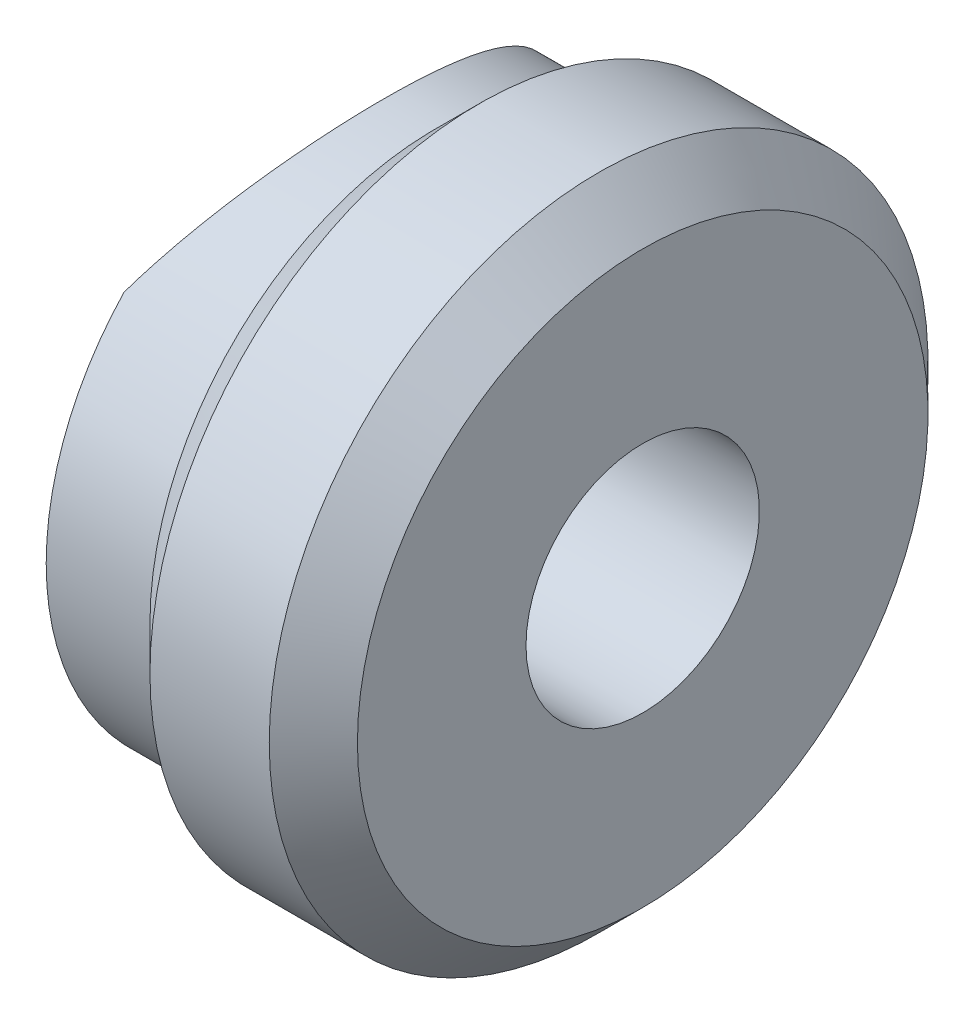
ISO-10303-21;
HEADER;
FILE_DESCRIPTION(('STEP AP214'),'2;1');
FILE_NAME('part.step','',(''),(''),'','','');
FILE_SCHEMA(('AUTOMOTIVE_DESIGN { 1 0 10303 214 1 1 1 1 }'));
ENDSEC;
DATA;
#1=APPLICATION_CONTEXT('core data for automotive mechanical design processes');
#2=APPLICATION_PROTOCOL_DEFINITION('international standard','automotive_design',2000,#1);
#3=PRODUCT_CONTEXT('',#1,'mechanical');
#4=PRODUCT('Part','Part','',(#3));
#5=PRODUCT_RELATED_PRODUCT_CATEGORY('part','',(#4));
#6=PRODUCT_DEFINITION_FORMATION('','',#4);
#7=PRODUCT_DEFINITION_CONTEXT('part definition',#1,'design');
#8=PRODUCT_DEFINITION('design','',#6,#7);
#9=PRODUCT_DEFINITION_SHAPE('','',#8);
#10=(LENGTH_UNIT() NAMED_UNIT(*) SI_UNIT(.MILLI.,.METRE.));
#11=(NAMED_UNIT(*) PLANE_ANGLE_UNIT() SI_UNIT($,.RADIAN.));
#12=(NAMED_UNIT(*) SI_UNIT($,.STERADIAN.) SOLID_ANGLE_UNIT());
#13=UNCERTAINTY_MEASURE_WITH_UNIT(LENGTH_MEASURE(1.E-05),#10,'distance_accuracy_value','');
#14=(GEOMETRIC_REPRESENTATION_CONTEXT(3) GLOBAL_UNCERTAINTY_ASSIGNED_CONTEXT((#13)) GLOBAL_UNIT_ASSIGNED_CONTEXT((#10,
#11,#12)) REPRESENTATION_CONTEXT('',''));
#15=CARTESIAN_POINT('',(0.,0.,0.));
#16=DIRECTION('',(0.,0.,1.));
#17=DIRECTION('',(1.,0.,0.));
#18=AXIS2_PLACEMENT_3D('',#15,#16,#17);
#19=CARTESIAN_POINT('',(0.,5.5,0.));
#20=DIRECTION('',(1.,0.,0.));
#21=DIRECTION('',(0.,0.,-1.));
#22=AXIS2_PLACEMENT_3D('',#19,#20,#21);
#23=PLANE('',#22);
#24=CARTESIAN_POINT('',(0.,0.,0.));
#25=DIRECTION('',(-1.,0.,0.));
#26=DIRECTION('',(0.,0.,1.));
#27=AXIS2_PLACEMENT_3D('',#24,#25,#26);
#28=CIRCLE('',#27,5.5);
#29=CARTESIAN_POINT('',(0.,3.77491721763537,-4.));
#30=VERTEX_POINT('',#29);
#31=CARTESIAN_POINT('',(0.,-3.77491721763537,-4.));
#32=VERTEX_POINT('',#31);
#33=EDGE_CURVE('E75',#30,#32,#28,.T.);
#34=ORIENTED_EDGE('',*,*,#33,.T.);
#35=DIRECTION('',(0.,1.,0.));
#36=VECTOR('',#35,1.);
#37=CARTESIAN_POINT('',(0.,-6.35,-4.));
#38=LINE('',#37,#36);
#39=EDGE_CURVE('E62',#32,#30,#38,.T.);
#40=ORIENTED_EDGE('',*,*,#39,.T.);
#41=EDGE_LOOP('',(#34,#40));
#42=FACE_BOUND('',#41,.T.);
#43=ADVANCED_FACE('F37',(#42),#23,.F.);
#44=CARTESIAN_POINT('',(0.,-3.77491721763537,4.));
#45=VERTEX_POINT('',#44);
#46=CARTESIAN_POINT('',(0.,3.77491721763537,4.));
#47=VERTEX_POINT('',#46);
#48=EDGE_CURVE('E81',#45,#47,#28,.T.);
#49=ORIENTED_EDGE('',*,*,#48,.T.);
#50=DIRECTION('',(0.,1.,0.));
#51=VECTOR('',#50,1.);
#52=CARTESIAN_POINT('',(0.,-6.35,4.));
#53=LINE('',#52,#51);
#54=EDGE_CURVE('E57',#47,#45,#53,.F.);
#55=ORIENTED_EDGE('',*,*,#54,.T.);
#56=EDGE_LOOP('',(#49,#55));
#57=FACE_BOUND('',#56,.T.);
#58=ADVANCED_FACE('F39',(#57),#23,.F.);
#59=CARTESIAN_POINT('',(14.2663972533086,0.,0.));
#60=DIRECTION('',(-1.,0.,0.));
#61=DIRECTION('',(0.,0.,1.));
#62=AXIS2_PLACEMENT_3D('',#59,#60,#61);
#63=CYLINDRICAL_SURFACE('',#62,2.25);
#64=CARTESIAN_POINT('',(0.696798155377504,0.,2.25));
#65=CARTESIAN_POINT('',(0.696800336243544,0.123984000277628,2.24999694180408));
#66=CARTESIAN_POINT('',(0.699641958491545,0.248000541210924,2.23971706610501));
#67=CARTESIAN_POINT('',(0.710668019696407,0.492454460856312,2.198945615888));
#68=CARTESIAN_POINT('',(0.718855190402104,0.612889976628974,2.16844370713168));
#69=CARTESIAN_POINT('',(0.739581579111227,0.846610240107898,2.0882990785985));
#70=CARTESIAN_POINT('',(0.752114736210524,0.959904688051027,2.03868300476042));
#71=CARTESIAN_POINT('',(0.78011321988806,1.17657868260619,1.92180166354043));
#72=CARTESIAN_POINT('',(0.795578761944733,1.27995749975355,1.85453509902009));
#73=CARTESIAN_POINT('',(0.828126544609124,1.47641390177836,1.70248951742595));
#74=CARTESIAN_POINT('',(0.845237112625162,1.56921090818649,1.61735395744878));
#75=CARTESIAN_POINT('',(0.878902367797732,1.73939021030035,1.4327540142738));
#76=CARTESIAN_POINT('',(0.895456997883071,1.81677092740614,1.33328816547564));
#77=CARTESIAN_POINT('',(0.92646089297205,1.95508843664353,1.12090838569079));
#78=CARTESIAN_POINT('',(0.940872842737256,2.01574668839292,1.00780712819347));
#79=CARTESIAN_POINT('',(0.965642735743144,2.1170815196129,0.772566710508234));
#80=CARTESIAN_POINT('',(0.976001352130434,2.15776141722221,0.650429055025735));
#81=CARTESIAN_POINT('',(0.991297146074105,2.21707784258281,0.403511110172188));
#82=CARTESIAN_POINT('',(0.996351504271652,2.23619155619043,0.278852839843893));
#83=CARTESIAN_POINT('',(1.00087883492573,2.25333394234215,0.0280034780646862));
#84=CARTESIAN_POINT('',(1.00035272838062,2.25136609418084,-0.0981873570184369));
#85=CARTESIAN_POINT('',(0.993864430437305,2.22673811776592,-0.345199776399061));
#86=CARTESIAN_POINT('',(0.988037672177914,2.20459348987647,-0.466076857336716));
#87=CARTESIAN_POINT('',(0.97176232783629,2.1410728615727,-0.702334013138002));
#88=CARTESIAN_POINT('',(0.961313480180149,2.09969577274563,-0.817713776487286));
#89=CARTESIAN_POINT('',(0.936766357662265,1.99848702483075,-1.04102215095086));
#90=CARTESIAN_POINT('',(0.922633211547865,1.93847791945919,-1.14886634833952));
#91=CARTESIAN_POINT('',(0.892241525112581,1.80184458047502,-1.3531303740591));
#92=CARTESIAN_POINT('',(0.875982576027986,1.72521714950741,-1.44954799839656));
#93=CARTESIAN_POINT('',(0.842521924538978,1.55478255420836,-1.63129857081783));
#94=CARTESIAN_POINT('',(0.825306582288439,1.46052567316851,-1.71620777876131));
#95=CARTESIAN_POINT('',(0.792318120205179,1.25893213077178,-1.86911637013184));
#96=CARTESIAN_POINT('',(0.776545085703407,1.1515946964081,-1.93711475347608));
#97=CARTESIAN_POINT('',(0.748173101972247,0.925978735248878,-2.05458778503724));
#98=CARTESIAN_POINT('',(0.735593761280222,0.807638436962875,-2.10394886477225));
#99=CARTESIAN_POINT('',(0.715277979231752,0.563923076463731,-2.18193716023719));
#100=CARTESIAN_POINT('',(0.707540357145011,0.438549737502498,-2.21056943128527));
#101=CARTESIAN_POINT('',(0.698035192945309,0.188286089350251,-2.24556016825425));
#102=CARTESIAN_POINT('',(0.696098464383479,0.063490389757465,-2.25255005779307));
#103=CARTESIAN_POINT('',(0.697951768004484,-0.185486384897615,-2.24579596911986));
#104=CARTESIAN_POINT('',(0.701741200841179,-0.309667522920006,-2.23205416085442));
#105=CARTESIAN_POINT('',(0.714456586763263,-0.551467965623231,-2.18478304951454));
#106=CARTESIAN_POINT('',(0.723284305865456,-0.66916685932232,-2.15163187005439));
#107=CARTESIAN_POINT('',(0.744985962224399,-0.897334212641376,-2.06690749717098));
#108=CARTESIAN_POINT('',(0.757860422090132,-1.00780173615157,-2.0153319242454));
#109=CARTESIAN_POINT('',(0.786553271152758,-1.22101639593545,-1.89393612864426));
#110=CARTESIAN_POINT('',(0.802429478170788,-1.32354399744671,-1.82374430356199));
#111=CARTESIAN_POINT('',(0.835200245464673,-1.51559721511982,-1.66757023068808));
#112=CARTESIAN_POINT('',(0.852094993872424,-1.60512041880039,-1.58158505971235));
#113=CARTESIAN_POINT('',(0.885580592333598,-1.77123708444753,-1.39334723217788));
#114=CARTESIAN_POINT('',(0.90214915034591,-1.84739064129859,-1.29070161878611));
#115=CARTESIAN_POINT('',(0.932622176127164,-1.98138535241069,-1.07371678547403));
#116=CARTESIAN_POINT('',(0.946526785571364,-2.03922748062479,-0.959378187911347));
#117=CARTESIAN_POINT('',(0.970015772103033,-2.13442943798227,-0.723057226149525));
#118=CARTESIAN_POINT('',(0.979632196178858,-2.17194166965456,-0.60113959611423));
#119=CARTESIAN_POINT('',(0.993602256949823,-2.2258632139593,-0.352439036803731));
#120=CARTESIAN_POINT('',(0.997957041550608,-2.24227712955607,-0.225657174963256));
#121=CARTESIAN_POINT('',(1.00085983743458,-2.25325126566286,0.0250604722587864));
#122=CARTESIAN_POINT('',(0.999579436695955,-2.2484572320522,0.148966409472796));
#123=CARTESIAN_POINT('',(0.991742857515348,-2.21864846463891,0.394141954180562));
#124=CARTESIAN_POINT('',(0.985186872006045,-2.19363447029748,0.515411657917082));
#125=CARTESIAN_POINT('',(0.967568926297863,-2.12445878218389,0.751107699159932));
#126=CARTESIAN_POINT('',(0.956537426575236,-2.08042639971573,0.865574416324463));
#127=CARTESIAN_POINT('',(0.931122938225478,-1.9745794685027,1.08556048681217));
#128=CARTESIAN_POINT('',(0.916739485008802,-1.91276245448245,1.19107859706731));
#129=CARTESIAN_POINT('',(0.885688545812915,-1.77120149421503,1.39318530515942));
#130=CARTESIAN_POINT('',(0.868970871851955,-1.69102818581808,1.48946543719377));
#131=CARTESIAN_POINT('',(0.835341422077096,-1.51584711664521,1.66742398064291));
#132=CARTESIAN_POINT('',(0.81842959657313,-1.42083547610706,1.74909856114582));
#133=CARTESIAN_POINT('',(0.785906991570973,-1.2162078520579,1.8972708258445));
#134=CARTESIAN_POINT('',(0.770332163785083,-1.10632095669767,1.96340296292341));
#135=CARTESIAN_POINT('',(0.742751593458661,-0.876589841056756,2.07615948784757));
#136=CARTESIAN_POINT('',(0.730743485748204,-0.756752287050643,2.12279681152532));
#137=CARTESIAN_POINT('',(0.713348745821455,-0.531106397719346,2.18903256232817));
#138=CARTESIAN_POINT('',(0.707192057426627,-0.426289031366718,2.21184214669942));
#139=CARTESIAN_POINT('',(0.698916042129299,-0.21432237600123,2.24232635318084));
#140=CARTESIAN_POINT('',(0.696796270209187,-0.10717334534135,2.25000264354342));
#141=CARTESIAN_POINT('',(0.696798155377504,0.,2.25));
#142=B_SPLINE_CURVE_WITH_KNOTS('',3,(#64,#65,#66,#67,#68,#69,#70,#71,#72,#73,#74,#75,#76,#77,
#78,#79,#80,#81,#82,#83,#84,#85,#86,#87,#88,#89,#90,#91,#92,#93,#94,#95,#96,#97,#98,#99,#100,
#101,#102,#103,#104,#105,#106,#107,#108,#109,#110,#111,#112,#113,#114,#115,#116,#117,#118,#119,
#120,#121,#122,#123,#124,#125,#126,#127,#128,#129,#130,#131,#132,#133,#134,#135,#136,#137,#138,
#139,#140,#141),.UNSPECIFIED.,.T.,.F.,(4,2,2,2,2,2,2,2,2,2,2,2,2,2,2,2,2,2,2,2,2,2,2,2,2,2,2,2,
2,2,2,2,2,2,2,2,2,2,4),(0.,0.371557971635309,0.743305970231715,1.11453760110695,
1.48579652152091,1.86532086241599,2.24488404596033,2.63043245150024,3.01591680090743,
3.39269333716487,3.76940769129443,4.13675920765005,4.50413151587257,4.87511584526133,
5.24617161521628,5.62845622010334,6.01076342740043,6.39536404560069,6.77987083621654,
7.15304843134812,7.52618696941451,7.89228731518204,8.25843495975225,8.63252754907452,
9.00668944894658,9.39148781847044,9.77626571779774,10.1581177737158,10.539886507824,
10.9101123860205,11.2803247253535,11.6480585642679,12.0158434024024,12.3933170752266,
12.7708896114263,13.156610044578,13.5420741241071,13.8632889681007,14.1844684002793),.UNSPECIFIED.);
#143=CARTESIAN_POINT('',(0.696798155377504,0.,2.25));
#144=VERTEX_POINT('',#143);
#145=EDGE_CURVE('E76',#144,#144,#142,.T.);
#146=ORIENTED_EDGE('',*,*,#145,.T.);
#147=EDGE_LOOP('',(#146));
#148=FACE_BOUND('',#147,.T.);
#149=CARTESIAN_POINT('',(6.,0.,0.));
#150=DIRECTION('',(-1.,0.,0.));
#151=DIRECTION('',(0.,0.,1.));
#152=AXIS2_PLACEMENT_3D('',#149,#150,#151);
#153=CIRCLE('',#152,2.25);
#154=CARTESIAN_POINT('',(6.,0.,2.25));
#155=VERTEX_POINT('',#154);
#156=EDGE_CURVE('E72',#155,#155,#153,.T.);
#157=ORIENTED_EDGE('',*,*,#156,.F.);
#158=EDGE_LOOP('',(#157));
#159=FACE_BOUND('',#158,.T.);
#160=ADVANCED_FACE('F116',(#148,#159),#63,.F.);
#161=CARTESIAN_POINT('',(6.,5.5,0.));
#162=DIRECTION('',(-1.,0.,0.));
#163=DIRECTION('',(0.,0.,1.));
#164=AXIS2_PLACEMENT_3D('',#161,#162,#163);
#165=PLANE('',#164);
#166=CARTESIAN_POINT('',(6.,0.,0.));
#167=DIRECTION('',(-1.,0.,0.));
#168=DIRECTION('',(0.,0.,1.));
#169=AXIS2_PLACEMENT_3D('',#166,#167,#168);
#170=CIRCLE('',#169,5.5);
#171=CARTESIAN_POINT('',(6.,0.,5.5));
#172=VERTEX_POINT('',#171);
#173=EDGE_CURVE('E95',#172,#172,#170,.T.);
#174=ORIENTED_EDGE('',*,*,#173,.F.);
#175=EDGE_LOOP('',(#174));
#176=FACE_BOUND('',#175,.T.);
#177=ORIENTED_EDGE('',*,*,#156,.T.);
#178=EDGE_LOOP('',(#177));
#179=FACE_BOUND('',#178,.T.);
#180=ADVANCED_FACE('F121',(#176,#179),#165,.F.);
#181=CARTESIAN_POINT('',(6.,0.,0.));
#182=DIRECTION('',(-1.,0.,0.));
#183=DIRECTION('',(0.,0.,1.));
#184=AXIS2_PLACEMENT_3D('',#181,#182,#183);
#185=CONICAL_SURFACE('',#184,5.5,0.785398163397448);
#186=CARTESIAN_POINT('',(5.15,0.,0.));
#187=DIRECTION('',(-1.,0.,0.));
#188=DIRECTION('',(0.,0.,1.));
#189=AXIS2_PLACEMENT_3D('',#186,#187,#188);
#190=CIRCLE('',#189,6.35);
#191=CARTESIAN_POINT('',(5.15,0.,6.35));
#192=VERTEX_POINT('',#191);
#193=EDGE_CURVE('E92',#192,#192,#190,.T.);
#194=ORIENTED_EDGE('',*,*,#193,.F.);
#195=EDGE_LOOP('',(#194));
#196=FACE_BOUND('',#195,.T.);
#197=ORIENTED_EDGE('',*,*,#173,.T.);
#198=EDGE_LOOP('',(#197));
#199=FACE_BOUND('',#198,.T.);
#200=ADVANCED_FACE('F127',(#196,#199),#185,.T.);
#201=CARTESIAN_POINT('',(14.2663972533086,0.,0.));
#202=DIRECTION('',(-1.,0.,0.));
#203=DIRECTION('',(0.,0.,1.));
#204=AXIS2_PLACEMENT_3D('',#201,#202,#203);
#205=CYLINDRICAL_SURFACE('',#204,6.35);
#206=CARTESIAN_POINT('',(2.85,0.,0.));
#207=DIRECTION('',(-1.,0.,0.));
#208=DIRECTION('',(0.,0.,1.));
#209=AXIS2_PLACEMENT_3D('',#206,#207,#208);
#210=CIRCLE('',#209,6.35);
#211=CARTESIAN_POINT('',(2.85,0.,6.35));
#212=VERTEX_POINT('',#211);
#213=EDGE_CURVE('E84',#212,#212,#210,.T.);
#214=ORIENTED_EDGE('',*,*,#213,.F.);
#215=EDGE_LOOP('',(#214));
#216=FACE_BOUND('',#215,.T.);
#217=ORIENTED_EDGE('',*,*,#193,.T.);
#218=EDGE_LOOP('',(#217));
#219=FACE_BOUND('',#218,.T.);
#220=ADVANCED_FACE('F136',(#216,#219),#205,.T.);
#221=CARTESIAN_POINT('',(2.85,0.,0.));
#222=DIRECTION('',(1.,0.,0.));
#223=DIRECTION('',(0.,0.,-1.));
#224=AXIS2_PLACEMENT_3D('',#221,#222,#223);
#225=CONICAL_SURFACE('',#224,6.35,0.78539816339745);
#226=CARTESIAN_POINT('',(2.,0.,0.));
#227=DIRECTION('',(-1.,0.,0.));
#228=DIRECTION('',(0.,0.,1.));
#229=AXIS2_PLACEMENT_3D('',#226,#227,#228);
#230=CIRCLE('',#229,5.5);
#231=CARTESIAN_POINT('',(2.,0.,5.5));
#232=VERTEX_POINT('',#231);
#233=EDGE_CURVE('E80',#232,#232,#230,.T.);
#234=ORIENTED_EDGE('',*,*,#233,.F.);
#235=EDGE_LOOP('',(#234));
#236=FACE_BOUND('',#235,.T.);
#237=ORIENTED_EDGE('',*,*,#213,.T.);
#238=EDGE_LOOP('',(#237));
#239=FACE_BOUND('',#238,.T.);
#240=ADVANCED_FACE('F111',(#236,#239),#225,.T.);
#241=CARTESIAN_POINT('',(14.2663972533086,0.,0.));
#242=DIRECTION('',(-1.,0.,0.));
#243=DIRECTION('',(0.,0.,1.));
#244=AXIS2_PLACEMENT_3D('',#241,#242,#243);
#245=CYLINDRICAL_SURFACE('',#244,5.5);
#246=ORIENTED_EDGE('',*,*,#48,.F.);
#247=CARTESIAN_POINT('',(0.,-3.77491721763537,4.));
#248=CARTESIAN_POINT('',(0.0546397943438764,-3.88344012903624,3.89757322014434));
#249=CARTESIAN_POINT('',(0.108962125961858,-3.98790733188164,3.79064324082935));
#250=CARTESIAN_POINT('',(0.215838522773983,-4.18824793962111,3.56805807270713));
#251=CARTESIAN_POINT('',(0.268391421921594,-4.28411574421317,3.45239728700854));
#252=CARTESIAN_POINT('',(0.370900023712211,-4.46730910609659,3.21187793052763));
#253=CARTESIAN_POINT('',(0.420833615464493,-4.55456616019034,3.08695759902624));
#254=CARTESIAN_POINT('',(0.516526720795574,-4.71902292312318,2.82916828835097));
#255=CARTESIAN_POINT('',(0.562286977917383,-4.79622442456547,2.69630073210836));
#256=CARTESIAN_POINT('',(0.648743252862659,-4.94017640971524,2.42253695901351));
#257=CARTESIAN_POINT('',(0.68941366496816,-5.00687445556635,2.28160496798832));
#258=CARTESIAN_POINT('',(0.76435852451428,-5.12853965844726,1.99313253736052));
#259=CARTESIAN_POINT('',(0.798633844183017,-5.18350841538457,1.84559300237114));
#260=CARTESIAN_POINT('',(0.859724595772189,-5.2807596396359,1.54543845794508));
#261=CARTESIAN_POINT('',(0.886564413456289,-5.32308361397737,1.3928419225878));
#262=CARTESIAN_POINT('',(0.932120199640835,-5.39457247837218,1.08341490783952));
#263=CARTESIAN_POINT('',(0.950837546003057,-5.42373960033162,0.926585151352565));
#264=CARTESIAN_POINT('',(0.977885516970589,-5.46578148371481,0.628623514744031));
#265=CARTESIAN_POINT('',(0.987171226063806,-5.48015697268338,0.487788145726095));
#266=CARTESIAN_POINT('',(0.998700622594036,-5.49799598939326,0.205145864345303));
#267=CARTESIAN_POINT('',(1.00094497614142,-5.50146054930569,0.0633390451533879));
#268=CARTESIAN_POINT('',(0.998332253698273,-5.4974224092723,-0.220098947335175));
#269=CARTESIAN_POINT('',(0.993472742478216,-5.48991594842263,-0.361730043733543));
#270=CARTESIAN_POINT('',(0.976776530405512,-5.46404956109999,-0.64357568893869));
#271=CARTESIAN_POINT('',(0.964940022595682,-5.44568993491745,-0.78379027682892));
#272=CARTESIAN_POINT('',(0.935806245920126,-5.40028750340026,-1.05057622762471));
#273=CARTESIAN_POINT('',(0.919020843640959,-5.3740556721986,-1.17734256789996));
#274=CARTESIAN_POINT('',(0.880157160494736,-5.31296363208499,-1.42796324996246));
#275=CARTESIAN_POINT('',(0.858077208849343,-5.27810069938027,-1.55181665895372));
#276=CARTESIAN_POINT('',(0.784527324864854,-5.16111667689025,-1.91791153861302));
#277=CARTESIAN_POINT('',(0.725728925994573,-5.06657231799693,-2.15484920087829));
#278=CARTESIAN_POINT('',(0.588037836374924,-4.83994202206836,-2.62650425195858));
#279=CARTESIAN_POINT('',(0.507987091067095,-4.70561007529581,-2.85978243624259));
#280=CARTESIAN_POINT('',(0.336263880070599,-4.40703437246859,-3.30136285224153));
#281=CARTESIAN_POINT('',(0.244599642226072,-4.24281175752337,-3.5096825650184));
#282=CARTESIAN_POINT('',(0.125558163352804,-4.01879155061181,-3.75554525222269));
#283=CARTESIAN_POINT('',(0.100586008850354,-3.97122447063315,-3.80580666490729));
#284=CARTESIAN_POINT('',(0.0504324137483663,-3.87437042315936,-3.9043581062536));
#285=CARTESIAN_POINT('',(0.0252513700606755,-3.82508631711589,-3.95265114871557));
#286=CARTESIAN_POINT('',(0.,-3.77491721763556,-4.00000000000017));
#287=B_SPLINE_CURVE_WITH_KNOTS('',3,(#247,#248,#249,#250,#251,#252,#253,#254,#255,#256,#257,
#258,#259,#260,#261,#262,#263,#264,#265,#266,#267,#268,#269,#270,#271,#272,#273,#274,#275,#276,
#277,#278,#279,#280,#281,#282,#283,#284,#285,#286),.UNSPECIFIED.,.F.,.F.,(4,2,2,2,2,2,2,2,2,2,2,
2,2,2,2,2,2,2,2,4),(0.,0.476665883312485,0.953639971980739,1.43414562471564,1.91456550013326,
2.39731259997437,2.87999380962063,3.36107273571393,3.84207002167573,4.26710549322586,
4.69210075532033,5.11724174143621,5.54237096510384,5.93353309272247,6.32481882052556,
7.1069009142377,7.94638192774811,8.78527148315059,9.00595356029185,9.22628397740978),.UNSPECIFIED.);
#288=EDGE_CURVE('E11',#45,#32,#287,.T.);
#289=ORIENTED_EDGE('',*,*,#288,.T.);
#290=ORIENTED_EDGE('',*,*,#33,.F.);
#291=CARTESIAN_POINT('',(0.,3.77491721763537,-4.));
#292=CARTESIAN_POINT('',(0.0546397943438764,3.88344012903624,-3.89757322014434));
#293=CARTESIAN_POINT('',(0.108962125961858,3.98790733188164,-3.79064324082935));
#294=CARTESIAN_POINT('',(0.215838522773983,4.18824793962111,-3.56805807270713));
#295=CARTESIAN_POINT('',(0.268391421921594,4.28411574421317,-3.45239728700854));
#296=CARTESIAN_POINT('',(0.370900023712211,4.46730910609659,-3.21187793052763));
#297=CARTESIAN_POINT('',(0.420833615464493,4.55456616019034,-3.08695759902624));
#298=CARTESIAN_POINT('',(0.516526720795574,4.71902292312318,-2.82916828835097));
#299=CARTESIAN_POINT('',(0.562286977917383,4.79622442456547,-2.69630073210836));
#300=CARTESIAN_POINT('',(0.648743252862659,4.94017640971524,-2.42253695901351));
#301=CARTESIAN_POINT('',(0.68941366496816,5.00687445556635,-2.28160496798832));
#302=CARTESIAN_POINT('',(0.76435852451428,5.12853965844726,-1.99313253736052));
#303=CARTESIAN_POINT('',(0.798633844183017,5.18350841538457,-1.84559300237114));
#304=CARTESIAN_POINT('',(0.859724595772189,5.2807596396359,-1.54543845794508));
#305=CARTESIAN_POINT('',(0.886564413456289,5.32308361397737,-1.3928419225878));
#306=CARTESIAN_POINT('',(0.932120199640835,5.39457247837218,-1.08341490783952));
#307=CARTESIAN_POINT('',(0.950837546003057,5.42373960033162,-0.926585151352565));
#308=CARTESIAN_POINT('',(0.977885516970589,5.46578148371481,-0.628623514744031));
#309=CARTESIAN_POINT('',(0.987171226063806,5.48015697268338,-0.487788145726095));
#310=CARTESIAN_POINT('',(0.998700622594036,5.49799598939326,-0.205145864345303));
#311=CARTESIAN_POINT('',(1.00094497614142,5.50146054930569,-0.0633390451533879));
#312=CARTESIAN_POINT('',(0.998332253698273,5.4974224092723,0.220098947335175));
#313=CARTESIAN_POINT('',(0.993472742478216,5.48991594842263,0.361730043733543));
#314=CARTESIAN_POINT('',(0.976776530405512,5.46404956109999,0.64357568893869));
#315=CARTESIAN_POINT('',(0.964940022595682,5.44568993491745,0.78379027682892));
#316=CARTESIAN_POINT('',(0.935806245920126,5.40028750340026,1.05057622762471));
#317=CARTESIAN_POINT('',(0.919020843640959,5.3740556721986,1.17734256789996));
#318=CARTESIAN_POINT('',(0.880157160494736,5.31296363208499,1.42796324996246));
#319=CARTESIAN_POINT('',(0.858077208849343,5.27810069938027,1.55181665895372));
#320=CARTESIAN_POINT('',(0.784527324864854,5.16111667689025,1.91791153861302));
#321=CARTESIAN_POINT('',(0.725728925994573,5.06657231799693,2.15484920087829));
#322=CARTESIAN_POINT('',(0.588037836374924,4.83994202206836,2.62650425195858));
#323=CARTESIAN_POINT('',(0.507987091067095,4.70561007529581,2.85978243624259));
#324=CARTESIAN_POINT('',(0.336263880070599,4.40703437246859,3.30136285224153));
#325=CARTESIAN_POINT('',(0.244599642226072,4.24281175752337,3.5096825650184));
#326=CARTESIAN_POINT('',(0.125558163352804,4.01879155061181,3.75554525222269));
#327=CARTESIAN_POINT('',(0.100586008850354,3.97122447063315,3.80580666490729));
#328=CARTESIAN_POINT('',(0.0504324137483663,3.87437042315936,3.9043581062536));
#329=CARTESIAN_POINT('',(0.0252513700606755,3.82508631711589,3.95265114871557));
#330=CARTESIAN_POINT('',(0.,3.77491721763556,4.00000000000017));
#331=B_SPLINE_CURVE_WITH_KNOTS('',3,(#291,#292,#293,#294,#295,#296,#297,#298,#299,#300,#301,
#302,#303,#304,#305,#306,#307,#308,#309,#310,#311,#312,#313,#314,#315,#316,#317,#318,#319,#320,
#321,#322,#323,#324,#325,#326,#327,#328,#329,#330),.UNSPECIFIED.,.F.,.F.,(4,2,2,2,2,2,2,2,2,2,2,
2,2,2,2,2,2,2,2,4),(0.,0.476665883312485,0.953639971980739,1.43414562471564,1.91456550013326,
2.39731259997437,2.87999380962063,3.36107273571393,3.84207002167573,4.26710549322586,
4.69210075532033,5.11724174143621,5.54237096510384,5.93353309272247,6.32481882052556,
7.1069009142377,7.94638192774811,8.78527148315059,9.00595356029185,9.22628397740978),.UNSPECIFIED.);
#332=EDGE_CURVE('E50',#30,#47,#331,.T.);
#333=ORIENTED_EDGE('',*,*,#332,.T.);
#334=EDGE_LOOP('',(#246,#289,#290,#333));
#335=FACE_BOUND('',#334,.T.);
#336=ORIENTED_EDGE('',*,*,#233,.T.);
#337=EDGE_LOOP('',(#336));
#338=FACE_BOUND('',#337,.T.);
#339=ADVANCED_FACE('F78',(#335,#338),#245,.T.);
#340=CARTESIAN_POINT('',(-7.5,-6.35,0.));
#341=DIRECTION('',(0.,1.,0.));
#342=DIRECTION('',(0.,0.,1.));
#343=AXIS2_PLACEMENT_3D('',#340,#341,#342);
#344=CYLINDRICAL_SURFACE('',#343,8.5);
#345=ORIENTED_EDGE('',*,*,#54,.F.);
#346=ORIENTED_EDGE('',*,*,#332,.F.);
#347=ORIENTED_EDGE('',*,*,#39,.F.);
#348=ORIENTED_EDGE('',*,*,#288,.F.);
#349=EDGE_LOOP('',(#345,#346,#347,#348));
#350=FACE_BOUND('',#349,.T.);
#351=ORIENTED_EDGE('',*,*,#145,.F.);
#352=EDGE_LOOP('',(#351));
#353=FACE_BOUND('',#352,.T.);
#354=ADVANCED_FACE('F66',(#350,#353),#344,.F.);
#355=CLOSED_SHELL('',(#43,#58,#160,#180,#200,#220,#240,#339,#354));
#356=MANIFOLD_SOLID_BREP('B2',#355);
#357=ADVANCED_BREP_SHAPE_REPRESENTATION('',(#18,#356),#14);
#358=SHAPE_DEFINITION_REPRESENTATION(#9,#357);
ENDSEC;
END-ISO-10303-21;
